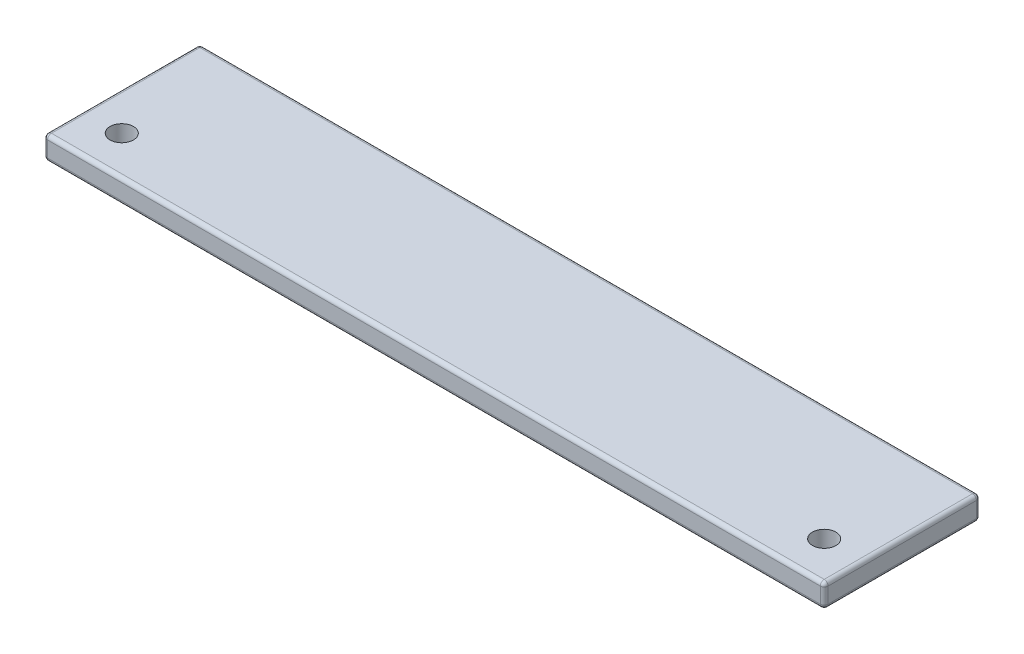
ISO-10303-21;
HEADER;
FILE_DESCRIPTION(('STEP AP214'),'2;1');
FILE_NAME('part.step','',(''),(''),'','','');
FILE_SCHEMA(('AUTOMOTIVE_DESIGN { 1 0 10303 214 1 1 1 1 }'));
ENDSEC;
DATA;
#1=APPLICATION_CONTEXT('core data for automotive mechanical design processes');
#2=APPLICATION_PROTOCOL_DEFINITION('international standard','automotive_design',2000,#1);
#3=PRODUCT_CONTEXT('',#1,'mechanical');
#4=PRODUCT('Part','Part','',(#3));
#5=PRODUCT_RELATED_PRODUCT_CATEGORY('part','',(#4));
#6=PRODUCT_DEFINITION_FORMATION('','',#4);
#7=PRODUCT_DEFINITION_CONTEXT('part definition',#1,'design');
#8=PRODUCT_DEFINITION('design','',#6,#7);
#9=PRODUCT_DEFINITION_SHAPE('','',#8);
#10=(LENGTH_UNIT() NAMED_UNIT(*) SI_UNIT(.MILLI.,.METRE.));
#11=(NAMED_UNIT(*) PLANE_ANGLE_UNIT() SI_UNIT($,.RADIAN.));
#12=(NAMED_UNIT(*) SI_UNIT($,.STERADIAN.) SOLID_ANGLE_UNIT());
#13=UNCERTAINTY_MEASURE_WITH_UNIT(LENGTH_MEASURE(1.E-05),#10,'distance_accuracy_value','');
#14=(GEOMETRIC_REPRESENTATION_CONTEXT(3) GLOBAL_UNCERTAINTY_ASSIGNED_CONTEXT((#13)) GLOBAL_UNIT_ASSIGNED_CONTEXT((#10,
#11,#12)) REPRESENTATION_CONTEXT('',''));
#15=CARTESIAN_POINT('',(0.,0.,0.));
#16=DIRECTION('',(0.,0.,1.));
#17=DIRECTION('',(1.,0.,0.));
#18=AXIS2_PLACEMENT_3D('',#15,#16,#17);
#19=CARTESIAN_POINT('',(0.,3.,0.));
#20=DIRECTION('',(0.,1.,0.));
#21=DIRECTION('',(0.,0.,1.));
#22=AXIS2_PLACEMENT_3D('',#19,#20,#21);
#23=PLANE('',#22);
#24=DIRECTION('',(0.,0.,-1.));
#25=VECTOR('',#24,1.);
#26=CARTESIAN_POINT('',(49.5,3.,-10.));
#27=LINE('',#26,#25);
#28=CARTESIAN_POINT('',(49.5,3.,9.5));
#29=VERTEX_POINT('',#28);
#30=CARTESIAN_POINT('',(49.5,3.,-9.5));
#31=VERTEX_POINT('',#30);
#32=EDGE_CURVE('E44',#29,#31,#27,.T.);
#33=ORIENTED_EDGE('',*,*,#32,.T.);
#34=DIRECTION('',(-1.,0.,0.));
#35=VECTOR('',#34,1.);
#36=CARTESIAN_POINT('',(-50.,3.,-9.49999999999999));
#37=LINE('',#36,#35);
#38=CARTESIAN_POINT('',(-49.5,3.,-9.49999999999999));
#39=VERTEX_POINT('',#38);
#40=EDGE_CURVE('E11',#31,#39,#37,.T.);
#41=ORIENTED_EDGE('',*,*,#40,.T.);
#42=DIRECTION('',(0.,0.,1.));
#43=VECTOR('',#42,1.);
#44=CARTESIAN_POINT('',(-49.5,3.,10.));
#45=LINE('',#44,#43);
#46=CARTESIAN_POINT('',(-49.5,3.,9.50000000000001));
#47=VERTEX_POINT('',#46);
#48=EDGE_CURVE('E202',#39,#47,#45,.T.);
#49=ORIENTED_EDGE('',*,*,#48,.T.);
#50=DIRECTION('',(1.,0.,0.));
#51=VECTOR('',#50,1.);
#52=CARTESIAN_POINT('',(50.,3.,9.5));
#53=LINE('',#52,#51);
#54=EDGE_CURVE('E55',#47,#29,#53,.T.);
#55=ORIENTED_EDGE('',*,*,#54,.T.);
#56=EDGE_LOOP('',(#33,#41,#49,#55));
#57=FACE_BOUND('',#56,.T.);
#58=CARTESIAN_POINT('',(45.,3.,5.));
#59=DIRECTION('',(0.,-1.,0.));
#60=DIRECTION('',(0.,0.,-1.));
#61=AXIS2_PLACEMENT_3D('',#58,#59,#60);
#62=CIRCLE('',#61,1.5);
#63=CARTESIAN_POINT('',(45.,3.,3.5));
#64=VERTEX_POINT('',#63);
#65=EDGE_CURVE('E209',#64,#64,#62,.T.);
#66=ORIENTED_EDGE('',*,*,#65,.T.);
#67=EDGE_LOOP('',(#66));
#68=FACE_BOUND('',#67,.T.);
#69=CARTESIAN_POINT('',(-45.,3.,5.));
#70=DIRECTION('',(0.,1.,0.));
#71=DIRECTION('',(0.,0.,-1.));
#72=AXIS2_PLACEMENT_3D('',#69,#70,#71);
#73=CIRCLE('',#72,1.5);
#74=CARTESIAN_POINT('',(-45.,3.,3.5));
#75=VERTEX_POINT('',#74);
#76=EDGE_CURVE('E309',#75,#75,#73,.T.);
#77=ORIENTED_EDGE('',*,*,#76,.F.);
#78=EDGE_LOOP('',(#77));
#79=FACE_BOUND('',#78,.T.);
#80=ADVANCED_FACE('F35',(#57,#68,#79),#23,.T.);
#81=CARTESIAN_POINT('',(0.,0.,0.));
#82=DIRECTION('',(0.,1.,0.));
#83=DIRECTION('',(0.,0.,1.));
#84=AXIS2_PLACEMENT_3D('',#81,#82,#83);
#85=PLANE('',#84);
#86=CARTESIAN_POINT('',(45.,0.,5.));
#87=DIRECTION('',(0.,-1.,0.));
#88=DIRECTION('',(0.,0.,-1.));
#89=AXIS2_PLACEMENT_3D('',#86,#87,#88);
#90=CIRCLE('',#89,1.5);
#91=CARTESIAN_POINT('',(45.,0.,3.5));
#92=VERTEX_POINT('',#91);
#93=EDGE_CURVE('E161',#92,#92,#90,.T.);
#94=ORIENTED_EDGE('',*,*,#93,.F.);
#95=EDGE_LOOP('',(#94));
#96=FACE_BOUND('',#95,.T.);
#97=DIRECTION('',(0.,0.,-1.));
#98=VECTOR('',#97,1.);
#99=CARTESIAN_POINT('',(49.5,0.,0.));
#100=LINE('',#99,#98);
#101=CARTESIAN_POINT('',(49.5,0.,-9.5));
#102=VERTEX_POINT('',#101);
#103=CARTESIAN_POINT('',(49.5,0.,9.5));
#104=VERTEX_POINT('',#103);
#105=EDGE_CURVE('E170',#102,#104,#100,.F.);
#106=ORIENTED_EDGE('',*,*,#105,.T.);
#107=DIRECTION('',(1.,0.,0.));
#108=VECTOR('',#107,1.);
#109=CARTESIAN_POINT('',(0.,0.,9.5));
#110=LINE('',#109,#108);
#111=CARTESIAN_POINT('',(-49.5,0.,9.50000000000001));
#112=VERTEX_POINT('',#111);
#113=EDGE_CURVE('E172',#104,#112,#110,.F.);
#114=ORIENTED_EDGE('',*,*,#113,.T.);
#115=DIRECTION('',(0.,0.,1.));
#116=VECTOR('',#115,1.);
#117=CARTESIAN_POINT('',(-49.5,0.,0.));
#118=LINE('',#117,#116);
#119=CARTESIAN_POINT('',(-49.5,0.,-9.49999999999999));
#120=VERTEX_POINT('',#119);
#121=EDGE_CURVE('E166',#112,#120,#118,.F.);
#122=ORIENTED_EDGE('',*,*,#121,.T.);
#123=DIRECTION('',(-1.,0.,0.));
#124=VECTOR('',#123,1.);
#125=CARTESIAN_POINT('',(0.,0.,-9.5));
#126=LINE('',#125,#124);
#127=EDGE_CURVE('E168',#120,#102,#126,.F.);
#128=ORIENTED_EDGE('',*,*,#127,.T.);
#129=EDGE_LOOP('',(#106,#114,#122,#128));
#130=FACE_BOUND('',#129,.T.);
#131=CARTESIAN_POINT('',(-45.,0.,5.));
#132=DIRECTION('',(0.,1.,0.));
#133=DIRECTION('',(0.,0.,-1.));
#134=AXIS2_PLACEMENT_3D('',#131,#132,#133);
#135=CIRCLE('',#134,1.5);
#136=CARTESIAN_POINT('',(-45.,0.,3.5));
#137=VERTEX_POINT('',#136);
#138=EDGE_CURVE('E311',#137,#137,#135,.T.);
#139=ORIENTED_EDGE('',*,*,#138,.T.);
#140=EDGE_LOOP('',(#139));
#141=FACE_BOUND('',#140,.T.);
#142=ADVANCED_FACE('F302',(#96,#130,#141),#85,.F.);
#143=CARTESIAN_POINT('',(-50.,3.,10.));
#144=DIRECTION('',(1.,0.,0.));
#145=DIRECTION('',(0.,0.,-1.));
#146=AXIS2_PLACEMENT_3D('',#143,#144,#145);
#147=PLANE('',#146);
#148=DIRECTION('',(0.,0.,1.));
#149=VECTOR('',#148,1.);
#150=CARTESIAN_POINT('',(-50.,0.5,10.));
#151=LINE('',#150,#149);
#152=CARTESIAN_POINT('',(-50.,0.5,-9.49999999999999));
#153=VERTEX_POINT('',#152);
#154=CARTESIAN_POINT('',(-50.,0.5,9.50000000000001));
#155=VERTEX_POINT('',#154);
#156=EDGE_CURVE('E197',#153,#155,#151,.T.);
#157=ORIENTED_EDGE('',*,*,#156,.T.);
#158=DIRECTION('',(0.,-1.,0.));
#159=VECTOR('',#158,1.);
#160=CARTESIAN_POINT('',(-50.,3.,9.50000000000001));
#161=LINE('',#160,#159);
#162=CARTESIAN_POINT('',(-50.,2.5,9.50000000000001));
#163=VERTEX_POINT('',#162);
#164=EDGE_CURVE('E200',#155,#163,#161,.F.);
#165=ORIENTED_EDGE('',*,*,#164,.T.);
#166=DIRECTION('',(0.,0.,1.));
#167=VECTOR('',#166,1.);
#168=CARTESIAN_POINT('',(-50.,2.5,-9.99999999999999));
#169=LINE('',#168,#167);
#170=CARTESIAN_POINT('',(-50.,2.5,-9.49999999999999));
#171=VERTEX_POINT('',#170);
#172=EDGE_CURVE('E195',#163,#171,#169,.F.);
#173=ORIENTED_EDGE('',*,*,#172,.T.);
#174=DIRECTION('',(0.,-1.,0.));
#175=VECTOR('',#174,1.);
#176=CARTESIAN_POINT('',(-50.,3.,-9.49999999999999));
#177=LINE('',#176,#175);
#178=EDGE_CURVE('E193',#171,#153,#177,.T.);
#179=ORIENTED_EDGE('',*,*,#178,.T.);
#180=EDGE_LOOP('',(#157,#165,#173,#179));
#181=FACE_BOUND('',#180,.T.);
#182=ADVANCED_FACE('F332',(#181),#147,.F.);
#183=CARTESIAN_POINT('',(50.,3.,10.));
#184=DIRECTION('',(0.,0.,-1.));
#185=DIRECTION('',(-1.,0.,0.));
#186=AXIS2_PLACEMENT_3D('',#183,#184,#185);
#187=PLANE('',#186);
#188=DIRECTION('',(1.,0.,0.));
#189=VECTOR('',#188,1.);
#190=CARTESIAN_POINT('',(50.,0.5,10.));
#191=LINE('',#190,#189);
#192=CARTESIAN_POINT('',(-49.5,0.5,10.));
#193=VERTEX_POINT('',#192);
#194=CARTESIAN_POINT('',(49.5,0.5,10.));
#195=VERTEX_POINT('',#194);
#196=EDGE_CURVE('E134',#193,#195,#191,.T.);
#197=ORIENTED_EDGE('',*,*,#196,.T.);
#198=DIRECTION('',(0.,-1.,0.));
#199=VECTOR('',#198,1.);
#200=CARTESIAN_POINT('',(49.5,3.,10.));
#201=LINE('',#200,#199);
#202=CARTESIAN_POINT('',(49.5,2.5,10.));
#203=VERTEX_POINT('',#202);
#204=EDGE_CURVE('E130',#195,#203,#201,.F.);
#205=ORIENTED_EDGE('',*,*,#204,.T.);
#206=DIRECTION('',(1.,0.,0.));
#207=VECTOR('',#206,1.);
#208=CARTESIAN_POINT('',(-50.,2.5,10.));
#209=LINE('',#208,#207);
#210=CARTESIAN_POINT('',(-49.5,2.5,10.));
#211=VERTEX_POINT('',#210);
#212=EDGE_CURVE('E122',#203,#211,#209,.F.);
#213=ORIENTED_EDGE('',*,*,#212,.T.);
#214=DIRECTION('',(0.,-1.,0.));
#215=VECTOR('',#214,1.);
#216=CARTESIAN_POINT('',(-49.5,3.,10.));
#217=LINE('',#216,#215);
#218=EDGE_CURVE('E127',#211,#193,#217,.T.);
#219=ORIENTED_EDGE('',*,*,#218,.T.);
#220=EDGE_LOOP('',(#197,#205,#213,#219));
#221=FACE_BOUND('',#220,.T.);
#222=ADVANCED_FACE('F125',(#221),#187,.F.);
#223=CARTESIAN_POINT('',(50.,3.,10.));
#224=DIRECTION('',(-1.,0.,0.));
#225=DIRECTION('',(0.,0.,1.));
#226=AXIS2_PLACEMENT_3D('',#223,#224,#225);
#227=PLANE('',#226);
#228=DIRECTION('',(0.,0.,-1.));
#229=VECTOR('',#228,1.);
#230=CARTESIAN_POINT('',(50.,2.5,10.));
#231=LINE('',#230,#229);
#232=CARTESIAN_POINT('',(50.,2.5,-9.5));
#233=VERTEX_POINT('',#232);
#234=CARTESIAN_POINT('',(50.,2.5,9.5));
#235=VERTEX_POINT('',#234);
#236=EDGE_CURVE('E177',#233,#235,#231,.F.);
#237=ORIENTED_EDGE('',*,*,#236,.T.);
#238=DIRECTION('',(0.,-1.,0.));
#239=VECTOR('',#238,1.);
#240=CARTESIAN_POINT('',(50.,3.,9.5));
#241=LINE('',#240,#239);
#242=CARTESIAN_POINT('',(50.,0.5,9.5));
#243=VERTEX_POINT('',#242);
#244=EDGE_CURVE('E182',#235,#243,#241,.T.);
#245=ORIENTED_EDGE('',*,*,#244,.T.);
#246=DIRECTION('',(0.,0.,-1.));
#247=VECTOR('',#246,1.);
#248=CARTESIAN_POINT('',(50.,0.5,10.));
#249=LINE('',#248,#247);
#250=CARTESIAN_POINT('',(50.,0.5,-9.5));
#251=VERTEX_POINT('',#250);
#252=EDGE_CURVE('E179',#243,#251,#249,.T.);
#253=ORIENTED_EDGE('',*,*,#252,.T.);
#254=DIRECTION('',(0.,-1.,0.));
#255=VECTOR('',#254,1.);
#256=CARTESIAN_POINT('',(50.,3.,-9.5));
#257=LINE('',#256,#255);
#258=EDGE_CURVE('E175',#251,#233,#257,.F.);
#259=ORIENTED_EDGE('',*,*,#258,.T.);
#260=EDGE_LOOP('',(#237,#245,#253,#259));
#261=FACE_BOUND('',#260,.T.);
#262=ADVANCED_FACE('F269',(#261),#227,.F.);
#263=CARTESIAN_POINT('',(50.,3.,-10.));
#264=DIRECTION('',(0.,0.,1.));
#265=DIRECTION('',(1.,0.,0.));
#266=AXIS2_PLACEMENT_3D('',#263,#264,#265);
#267=PLANE('',#266);
#268=DIRECTION('',(-1.,0.,0.));
#269=VECTOR('',#268,1.);
#270=CARTESIAN_POINT('',(50.,2.5,-10.));
#271=LINE('',#270,#269);
#272=CARTESIAN_POINT('',(-49.5,2.5,-9.99999999999999));
#273=VERTEX_POINT('',#272);
#274=CARTESIAN_POINT('',(49.5,2.5,-10.));
#275=VERTEX_POINT('',#274);
#276=EDGE_CURVE('E186',#273,#275,#271,.F.);
#277=ORIENTED_EDGE('',*,*,#276,.T.);
#278=DIRECTION('',(0.,-1.,0.));
#279=VECTOR('',#278,1.);
#280=CARTESIAN_POINT('',(49.5,3.,-10.));
#281=LINE('',#280,#279);
#282=CARTESIAN_POINT('',(49.5,0.5,-10.));
#283=VERTEX_POINT('',#282);
#284=EDGE_CURVE('E191',#275,#283,#281,.T.);
#285=ORIENTED_EDGE('',*,*,#284,.T.);
#286=DIRECTION('',(-1.,0.,0.));
#287=VECTOR('',#286,1.);
#288=CARTESIAN_POINT('',(50.,0.5,-10.));
#289=LINE('',#288,#287);
#290=CARTESIAN_POINT('',(-49.5,0.5,-9.99999999999999));
#291=VERTEX_POINT('',#290);
#292=EDGE_CURVE('E188',#283,#291,#289,.T.);
#293=ORIENTED_EDGE('',*,*,#292,.T.);
#294=DIRECTION('',(0.,-1.,0.));
#295=VECTOR('',#294,1.);
#296=CARTESIAN_POINT('',(-49.5,3.,-9.99999999999999));
#297=LINE('',#296,#295);
#298=EDGE_CURVE('E184',#291,#273,#297,.F.);
#299=ORIENTED_EDGE('',*,*,#298,.T.);
#300=EDGE_LOOP('',(#277,#285,#293,#299));
#301=FACE_BOUND('',#300,.T.);
#302=ADVANCED_FACE('F278',(#301),#267,.F.);
#303=CARTESIAN_POINT('',(0.,2.5,-9.5));
#304=DIRECTION('',(1.,0.,0.));
#305=DIRECTION('',(0.,0.,-1.));
#306=AXIS2_PLACEMENT_3D('',#303,#304,#305);
#307=CYLINDRICAL_SURFACE('',#306,0.5);
#308=CARTESIAN_POINT('',(-49.5,2.5,-9.49999999999999));
#309=DIRECTION('',(-1.,0.,0.));
#310=DIRECTION('',(0.,0.,1.));
#311=AXIS2_PLACEMENT_3D('',#308,#309,#310);
#312=CIRCLE('',#311,0.5);
#313=EDGE_CURVE('E39',#39,#273,#312,.T.);
#314=ORIENTED_EDGE('',*,*,#313,.F.);
#315=ORIENTED_EDGE('',*,*,#40,.F.);
#316=CARTESIAN_POINT('',(49.5,2.5,-9.5));
#317=DIRECTION('',(1.,0.,0.));
#318=DIRECTION('',(0.,0.,-1.));
#319=AXIS2_PLACEMENT_3D('',#316,#317,#318);
#320=CIRCLE('',#319,0.5);
#321=EDGE_CURVE('E159',#275,#31,#320,.T.);
#322=ORIENTED_EDGE('',*,*,#321,.F.);
#323=ORIENTED_EDGE('',*,*,#276,.F.);
#324=EDGE_LOOP('',(#314,#315,#322,#323));
#325=FACE_BOUND('',#324,.T.);
#326=ADVANCED_FACE('F37',(#325),#307,.T.);
#327=CARTESIAN_POINT('',(-49.5,2.5,-9.49999999999999));
#328=DIRECTION('',(0.,0.,1.));
#329=DIRECTION('',(1.,0.,0.));
#330=AXIS2_PLACEMENT_3D('',#327,#328,#329);
#331=SPHERICAL_SURFACE('',#330,0.5);
#332=CARTESIAN_POINT('',(-49.5,2.5,-9.49999999999999));
#333=DIRECTION('',(0.,0.,-1.));
#334=DIRECTION('',(-1.,0.,0.));
#335=AXIS2_PLACEMENT_3D('',#332,#333,#334);
#336=CIRCLE('',#335,0.5);
#337=EDGE_CURVE('E249',#39,#171,#336,.F.);
#338=ORIENTED_EDGE('',*,*,#337,.F.);
#339=ORIENTED_EDGE('',*,*,#313,.T.);
#340=CARTESIAN_POINT('',(-49.5,2.5,-9.49999999999999));
#341=DIRECTION('',(0.,1.,0.));
#342=DIRECTION('',(0.,0.,1.));
#343=AXIS2_PLACEMENT_3D('',#340,#341,#342);
#344=CIRCLE('',#343,0.5);
#345=EDGE_CURVE('E252',#171,#273,#344,.F.);
#346=ORIENTED_EDGE('',*,*,#345,.F.);
#347=EDGE_LOOP('',(#338,#339,#346));
#348=FACE_BOUND('',#347,.T.);
#349=ADVANCED_FACE('F296',(#348),#331,.T.);
#350=CARTESIAN_POINT('',(49.5,2.5,-9.5));
#351=DIRECTION('',(0.,0.,1.));
#352=DIRECTION('',(1.,0.,0.));
#353=AXIS2_PLACEMENT_3D('',#350,#351,#352);
#354=SPHERICAL_SURFACE('',#353,0.5);
#355=CARTESIAN_POINT('',(49.5,2.5,-9.5));
#356=DIRECTION('',(0.,1.,0.));
#357=DIRECTION('',(0.,0.,1.));
#358=AXIS2_PLACEMENT_3D('',#355,#356,#357);
#359=CIRCLE('',#358,0.5);
#360=EDGE_CURVE('E243',#275,#233,#359,.F.);
#361=ORIENTED_EDGE('',*,*,#360,.F.);
#362=ORIENTED_EDGE('',*,*,#321,.T.);
#363=CARTESIAN_POINT('',(49.5,2.5,-9.5));
#364=DIRECTION('',(0.,0.,-1.));
#365=DIRECTION('',(-1.,0.,0.));
#366=AXIS2_PLACEMENT_3D('',#363,#364,#365);
#367=CIRCLE('',#366,0.5);
#368=EDGE_CURVE('E246',#233,#31,#367,.F.);
#369=ORIENTED_EDGE('',*,*,#368,.F.);
#370=EDGE_LOOP('',(#361,#362,#369));
#371=FACE_BOUND('',#370,.T.);
#372=ADVANCED_FACE('F259',(#371),#354,.T.);
#373=CARTESIAN_POINT('',(-49.5,3.,-9.49999999999999));
#374=DIRECTION('',(0.,-1.,0.));
#375=DIRECTION('',(0.,0.,-1.));
#376=AXIS2_PLACEMENT_3D('',#373,#374,#375);
#377=CYLINDRICAL_SURFACE('',#376,0.5);
#378=ORIENTED_EDGE('',*,*,#345,.T.);
#379=ORIENTED_EDGE('',*,*,#298,.F.);
#380=CARTESIAN_POINT('',(-49.5,0.5,-9.49999999999999));
#381=DIRECTION('',(0.,-1.,0.));
#382=DIRECTION('',(0.,0.,-1.));
#383=AXIS2_PLACEMENT_3D('',#380,#381,#382);
#384=CIRCLE('',#383,0.5);
#385=EDGE_CURVE('E238',#153,#291,#384,.T.);
#386=ORIENTED_EDGE('',*,*,#385,.F.);
#387=ORIENTED_EDGE('',*,*,#178,.F.);
#388=EDGE_LOOP('',(#378,#379,#386,#387));
#389=FACE_BOUND('',#388,.T.);
#390=ADVANCED_FACE('F290',(#389),#377,.T.);
#391=CARTESIAN_POINT('',(-49.5,2.5,0.));
#392=DIRECTION('',(0.,0.,-1.));
#393=DIRECTION('',(-1.,0.,0.));
#394=AXIS2_PLACEMENT_3D('',#391,#392,#393);
#395=CYLINDRICAL_SURFACE('',#394,0.5);
#396=ORIENTED_EDGE('',*,*,#337,.T.);
#397=ORIENTED_EDGE('',*,*,#172,.F.);
#398=CARTESIAN_POINT('',(-49.5,2.5,9.50000000000001));
#399=DIRECTION('',(0.,0.,1.));
#400=DIRECTION('',(1.,0.,0.));
#401=AXIS2_PLACEMENT_3D('',#398,#399,#400);
#402=CIRCLE('',#401,0.5);
#403=EDGE_CURVE('E143',#47,#163,#402,.T.);
#404=ORIENTED_EDGE('',*,*,#403,.F.);
#405=ORIENTED_EDGE('',*,*,#48,.F.);
#406=EDGE_LOOP('',(#396,#397,#404,#405));
#407=FACE_BOUND('',#406,.T.);
#408=ADVANCED_FACE('F299',(#407),#395,.T.);
#409=CARTESIAN_POINT('',(0.,2.5,9.5));
#410=DIRECTION('',(-1.,0.,0.));
#411=DIRECTION('',(0.,0.,1.));
#412=AXIS2_PLACEMENT_3D('',#409,#410,#411);
#413=CYLINDRICAL_SURFACE('',#412,0.5);
#414=CARTESIAN_POINT('',(49.5,2.5,9.5));
#415=DIRECTION('',(1.,0.,0.));
#416=DIRECTION('',(0.,0.,-1.));
#417=AXIS2_PLACEMENT_3D('',#414,#415,#416);
#418=CIRCLE('',#417,0.5);
#419=EDGE_CURVE('E144',#29,#203,#418,.T.);
#420=ORIENTED_EDGE('',*,*,#419,.F.);
#421=ORIENTED_EDGE('',*,*,#54,.F.);
#422=CARTESIAN_POINT('',(-49.5,2.5,9.50000000000001));
#423=DIRECTION('',(-1.,0.,0.));
#424=DIRECTION('',(0.,0.,1.));
#425=AXIS2_PLACEMENT_3D('',#422,#423,#424);
#426=CIRCLE('',#425,0.5);
#427=EDGE_CURVE('E137',#211,#47,#426,.T.);
#428=ORIENTED_EDGE('',*,*,#427,.F.);
#429=ORIENTED_EDGE('',*,*,#212,.F.);
#430=EDGE_LOOP('',(#420,#421,#428,#429));
#431=FACE_BOUND('',#430,.T.);
#432=ADVANCED_FACE('F139',(#431),#413,.T.);
#433=CARTESIAN_POINT('',(49.5,2.5,0.));
#434=DIRECTION('',(0.,0.,1.));
#435=DIRECTION('',(1.,0.,0.));
#436=AXIS2_PLACEMENT_3D('',#433,#434,#435);
#437=CYLINDRICAL_SURFACE('',#436,0.5);
#438=ORIENTED_EDGE('',*,*,#368,.T.);
#439=ORIENTED_EDGE('',*,*,#32,.F.);
#440=CARTESIAN_POINT('',(49.5,2.5,9.5));
#441=DIRECTION('',(0.,0.,1.));
#442=DIRECTION('',(1.,0.,0.));
#443=AXIS2_PLACEMENT_3D('',#440,#441,#442);
#444=CIRCLE('',#443,0.5);
#445=EDGE_CURVE('E233',#235,#29,#444,.T.);
#446=ORIENTED_EDGE('',*,*,#445,.F.);
#447=ORIENTED_EDGE('',*,*,#236,.F.);
#448=EDGE_LOOP('',(#438,#439,#446,#447));
#449=FACE_BOUND('',#448,.T.);
#450=ADVANCED_FACE('F265',(#449),#437,.T.);
#451=CARTESIAN_POINT('',(49.5,3.,-9.5));
#452=DIRECTION('',(0.,-1.,0.));
#453=DIRECTION('',(0.,0.,-1.));
#454=AXIS2_PLACEMENT_3D('',#451,#452,#453);
#455=CYLINDRICAL_SURFACE('',#454,0.5);
#456=ORIENTED_EDGE('',*,*,#360,.T.);
#457=ORIENTED_EDGE('',*,*,#258,.F.);
#458=CARTESIAN_POINT('',(49.5,0.5,-9.5));
#459=DIRECTION('',(0.,-1.,0.));
#460=DIRECTION('',(0.,0.,-1.));
#461=AXIS2_PLACEMENT_3D('',#458,#459,#460);
#462=CIRCLE('',#461,0.5);
#463=EDGE_CURVE('E230',#283,#251,#462,.T.);
#464=ORIENTED_EDGE('',*,*,#463,.F.);
#465=ORIENTED_EDGE('',*,*,#284,.F.);
#466=EDGE_LOOP('',(#456,#457,#464,#465));
#467=FACE_BOUND('',#466,.T.);
#468=ADVANCED_FACE('F275',(#467),#455,.T.);
#469=CARTESIAN_POINT('',(50.,0.5,-9.5));
#470=DIRECTION('',(-1.,0.,0.));
#471=DIRECTION('',(0.,0.,1.));
#472=AXIS2_PLACEMENT_3D('',#469,#470,#471);
#473=CYLINDRICAL_SURFACE('',#472,0.5);
#474=CARTESIAN_POINT('',(-49.5,0.5,-9.49999999999999));
#475=DIRECTION('',(-1.,0.,0.));
#476=DIRECTION('',(0.,0.,1.));
#477=AXIS2_PLACEMENT_3D('',#474,#475,#476);
#478=CIRCLE('',#477,0.5);
#479=EDGE_CURVE('E240',#291,#120,#478,.T.);
#480=ORIENTED_EDGE('',*,*,#479,.F.);
#481=ORIENTED_EDGE('',*,*,#292,.F.);
#482=CARTESIAN_POINT('',(49.5,0.5,-9.5));
#483=DIRECTION('',(1.,0.,0.));
#484=DIRECTION('',(0.,0.,-1.));
#485=AXIS2_PLACEMENT_3D('',#482,#483,#484);
#486=CIRCLE('',#485,0.5);
#487=EDGE_CURVE('E227',#102,#283,#486,.T.);
#488=ORIENTED_EDGE('',*,*,#487,.F.);
#489=ORIENTED_EDGE('',*,*,#127,.F.);
#490=EDGE_LOOP('',(#480,#481,#488,#489));
#491=FACE_BOUND('',#490,.T.);
#492=ADVANCED_FACE('F282',(#491),#473,.T.);
#493=CARTESIAN_POINT('',(-49.5,0.5,-9.49999999999999));
#494=DIRECTION('',(0.,0.,1.));
#495=DIRECTION('',(1.,0.,0.));
#496=AXIS2_PLACEMENT_3D('',#493,#494,#495);
#497=SPHERICAL_SURFACE('',#496,0.5);
#498=ORIENTED_EDGE('',*,*,#385,.T.);
#499=ORIENTED_EDGE('',*,*,#479,.T.);
#500=CARTESIAN_POINT('',(-49.5,0.5,-9.49999999999999));
#501=DIRECTION('',(0.,0.,-1.));
#502=DIRECTION('',(-1.,0.,0.));
#503=AXIS2_PLACEMENT_3D('',#500,#501,#502);
#504=CIRCLE('',#503,0.5);
#505=EDGE_CURVE('E151',#153,#120,#504,.F.);
#506=ORIENTED_EDGE('',*,*,#505,.F.);
#507=EDGE_LOOP('',(#498,#499,#506));
#508=FACE_BOUND('',#507,.T.);
#509=ADVANCED_FACE('F378',(#508),#497,.T.);
#510=CARTESIAN_POINT('',(-49.5,2.5,9.50000000000001));
#511=DIRECTION('',(0.,0.,1.));
#512=DIRECTION('',(1.,0.,0.));
#513=AXIS2_PLACEMENT_3D('',#510,#511,#512);
#514=SPHERICAL_SURFACE('',#513,0.5);
#515=ORIENTED_EDGE('',*,*,#427,.T.);
#516=ORIENTED_EDGE('',*,*,#403,.T.);
#517=CARTESIAN_POINT('',(-49.5,2.5,9.50000000000001));
#518=DIRECTION('',(0.,1.,0.));
#519=DIRECTION('',(0.,0.,1.));
#520=AXIS2_PLACEMENT_3D('',#517,#518,#519);
#521=CIRCLE('',#520,0.5);
#522=EDGE_CURVE('E147',#211,#163,#521,.F.);
#523=ORIENTED_EDGE('',*,*,#522,.F.);
#524=EDGE_LOOP('',(#515,#516,#523));
#525=FACE_BOUND('',#524,.T.);
#526=ADVANCED_FACE('F148',(#525),#514,.T.);
#527=CARTESIAN_POINT('',(49.5,2.5,9.5));
#528=DIRECTION('',(0.,0.,1.));
#529=DIRECTION('',(1.,0.,0.));
#530=AXIS2_PLACEMENT_3D('',#527,#528,#529);
#531=SPHERICAL_SURFACE('',#530,0.5);
#532=ORIENTED_EDGE('',*,*,#445,.T.);
#533=ORIENTED_EDGE('',*,*,#419,.T.);
#534=CARTESIAN_POINT('',(49.5,2.5,9.5));
#535=DIRECTION('',(0.,1.,0.));
#536=DIRECTION('',(0.,0.,1.));
#537=AXIS2_PLACEMENT_3D('',#534,#535,#536);
#538=CIRCLE('',#537,0.5);
#539=EDGE_CURVE('E152',#235,#203,#538,.F.);
#540=ORIENTED_EDGE('',*,*,#539,.F.);
#541=EDGE_LOOP('',(#532,#533,#540));
#542=FACE_BOUND('',#541,.T.);
#543=ADVANCED_FACE('F371',(#542),#531,.T.);
#544=CARTESIAN_POINT('',(49.5,0.5,-9.5));
#545=DIRECTION('',(0.,0.,1.));
#546=DIRECTION('',(1.,0.,0.));
#547=AXIS2_PLACEMENT_3D('',#544,#545,#546);
#548=SPHERICAL_SURFACE('',#547,0.5);
#549=ORIENTED_EDGE('',*,*,#487,.T.);
#550=ORIENTED_EDGE('',*,*,#463,.T.);
#551=CARTESIAN_POINT('',(49.5,0.5,-9.5));
#552=DIRECTION('',(0.,0.,-1.));
#553=DIRECTION('',(-1.,0.,0.));
#554=AXIS2_PLACEMENT_3D('',#551,#552,#553);
#555=CIRCLE('',#554,0.5);
#556=EDGE_CURVE('E221',#102,#251,#555,.F.);
#557=ORIENTED_EDGE('',*,*,#556,.F.);
#558=EDGE_LOOP('',(#549,#550,#557));
#559=FACE_BOUND('',#558,.T.);
#560=ADVANCED_FACE('F367',(#559),#548,.T.);
#561=CARTESIAN_POINT('',(-49.5,0.5,10.));
#562=DIRECTION('',(0.,0.,1.));
#563=DIRECTION('',(1.,0.,0.));
#564=AXIS2_PLACEMENT_3D('',#561,#562,#563);
#565=CYLINDRICAL_SURFACE('',#564,0.5);
#566=ORIENTED_EDGE('',*,*,#505,.T.);
#567=ORIENTED_EDGE('',*,*,#121,.F.);
#568=CARTESIAN_POINT('',(-49.5,0.5,9.50000000000001));
#569=DIRECTION('',(0.,0.,1.));
#570=DIRECTION('',(1.,0.,0.));
#571=AXIS2_PLACEMENT_3D('',#568,#569,#570);
#572=CIRCLE('',#571,0.5);
#573=EDGE_CURVE('E218',#155,#112,#572,.T.);
#574=ORIENTED_EDGE('',*,*,#573,.F.);
#575=ORIENTED_EDGE('',*,*,#156,.F.);
#576=EDGE_LOOP('',(#566,#567,#574,#575));
#577=FACE_BOUND('',#576,.T.);
#578=ADVANCED_FACE('F364',(#577),#565,.T.);
#579=CARTESIAN_POINT('',(-49.5,3.,9.50000000000001));
#580=DIRECTION('',(0.,-1.,0.));
#581=DIRECTION('',(0.,0.,-1.));
#582=AXIS2_PLACEMENT_3D('',#579,#580,#581);
#583=CYLINDRICAL_SURFACE('',#582,0.5);
#584=ORIENTED_EDGE('',*,*,#522,.T.);
#585=ORIENTED_EDGE('',*,*,#164,.F.);
#586=CARTESIAN_POINT('',(-49.5,0.5,9.50000000000001));
#587=DIRECTION('',(0.,-1.,0.));
#588=DIRECTION('',(0.,0.,-1.));
#589=AXIS2_PLACEMENT_3D('',#586,#587,#588);
#590=CIRCLE('',#589,0.5);
#591=EDGE_CURVE('E155',#193,#155,#590,.T.);
#592=ORIENTED_EDGE('',*,*,#591,.F.);
#593=ORIENTED_EDGE('',*,*,#218,.F.);
#594=EDGE_LOOP('',(#584,#585,#592,#593));
#595=FACE_BOUND('',#594,.T.);
#596=ADVANCED_FACE('F154',(#595),#583,.T.);
#597=CARTESIAN_POINT('',(49.5,3.,9.5));
#598=DIRECTION('',(0.,-1.,0.));
#599=DIRECTION('',(0.,0.,-1.));
#600=AXIS2_PLACEMENT_3D('',#597,#598,#599);
#601=CYLINDRICAL_SURFACE('',#600,0.5);
#602=ORIENTED_EDGE('',*,*,#539,.T.);
#603=ORIENTED_EDGE('',*,*,#204,.F.);
#604=CARTESIAN_POINT('',(49.5,0.5,9.5));
#605=DIRECTION('',(0.,-1.,0.));
#606=DIRECTION('',(0.,0.,-1.));
#607=AXIS2_PLACEMENT_3D('',#604,#605,#606);
#608=CIRCLE('',#607,0.5);
#609=EDGE_CURVE('E214',#243,#195,#608,.T.);
#610=ORIENTED_EDGE('',*,*,#609,.F.);
#611=ORIENTED_EDGE('',*,*,#244,.F.);
#612=EDGE_LOOP('',(#602,#603,#610,#611));
#613=FACE_BOUND('',#612,.T.);
#614=ADVANCED_FACE('F357',(#613),#601,.T.);
#615=CARTESIAN_POINT('',(49.5,0.5,10.));
#616=DIRECTION('',(0.,0.,-1.));
#617=DIRECTION('',(-1.,0.,0.));
#618=AXIS2_PLACEMENT_3D('',#615,#616,#617);
#619=CYLINDRICAL_SURFACE('',#618,0.5);
#620=ORIENTED_EDGE('',*,*,#556,.T.);
#621=ORIENTED_EDGE('',*,*,#252,.F.);
#622=CARTESIAN_POINT('',(49.5,0.5,9.5));
#623=DIRECTION('',(0.,0.,1.));
#624=DIRECTION('',(1.,0.,0.));
#625=AXIS2_PLACEMENT_3D('',#622,#623,#624);
#626=CIRCLE('',#625,0.5);
#627=EDGE_CURVE('E211',#104,#243,#626,.T.);
#628=ORIENTED_EDGE('',*,*,#627,.F.);
#629=ORIENTED_EDGE('',*,*,#105,.F.);
#630=EDGE_LOOP('',(#620,#621,#628,#629));
#631=FACE_BOUND('',#630,.T.);
#632=ADVANCED_FACE('F353',(#631),#619,.T.);
#633=CARTESIAN_POINT('',(-49.5,0.5,9.50000000000001));
#634=DIRECTION('',(0.,0.,1.));
#635=DIRECTION('',(1.,0.,0.));
#636=AXIS2_PLACEMENT_3D('',#633,#634,#635);
#637=SPHERICAL_SURFACE('',#636,0.5);
#638=ORIENTED_EDGE('',*,*,#591,.T.);
#639=ORIENTED_EDGE('',*,*,#573,.T.);
#640=CARTESIAN_POINT('',(-49.5,0.5,9.50000000000001));
#641=DIRECTION('',(-1.,0.,0.));
#642=DIRECTION('',(0.,0.,1.));
#643=AXIS2_PLACEMENT_3D('',#640,#641,#642);
#644=CIRCLE('',#643,0.5);
#645=EDGE_CURVE('E208',#193,#112,#644,.F.);
#646=ORIENTED_EDGE('',*,*,#645,.F.);
#647=EDGE_LOOP('',(#638,#639,#646));
#648=FACE_BOUND('',#647,.T.);
#649=ADVANCED_FACE('F349',(#648),#637,.T.);
#650=CARTESIAN_POINT('',(49.5,0.5,9.5));
#651=DIRECTION('',(0.,0.,1.));
#652=DIRECTION('',(1.,0.,0.));
#653=AXIS2_PLACEMENT_3D('',#650,#651,#652);
#654=SPHERICAL_SURFACE('',#653,0.5);
#655=ORIENTED_EDGE('',*,*,#627,.T.);
#656=ORIENTED_EDGE('',*,*,#609,.T.);
#657=CARTESIAN_POINT('',(49.5,0.5,9.5));
#658=DIRECTION('',(1.,0.,0.));
#659=DIRECTION('',(0.,0.,-1.));
#660=AXIS2_PLACEMENT_3D('',#657,#658,#659);
#661=CIRCLE('',#660,0.5);
#662=EDGE_CURVE('E206',#104,#195,#661,.F.);
#663=ORIENTED_EDGE('',*,*,#662,.F.);
#664=EDGE_LOOP('',(#655,#656,#663));
#665=FACE_BOUND('',#664,.T.);
#666=ADVANCED_FACE('F345',(#665),#654,.T.);
#667=CARTESIAN_POINT('',(50.,0.5,9.5));
#668=DIRECTION('',(1.,0.,0.));
#669=DIRECTION('',(0.,0.,-1.));
#670=AXIS2_PLACEMENT_3D('',#667,#668,#669);
#671=CYLINDRICAL_SURFACE('',#670,0.5);
#672=ORIENTED_EDGE('',*,*,#645,.T.);
#673=ORIENTED_EDGE('',*,*,#113,.F.);
#674=ORIENTED_EDGE('',*,*,#662,.T.);
#675=ORIENTED_EDGE('',*,*,#196,.F.);
#676=EDGE_LOOP('',(#672,#673,#674,#675));
#677=FACE_BOUND('',#676,.T.);
#678=ADVANCED_FACE('F326',(#677),#671,.T.);
#679=CARTESIAN_POINT('',(45.,3.,5.));
#680=DIRECTION('',(0.,-1.,0.));
#681=DIRECTION('',(0.,0.,-1.));
#682=AXIS2_PLACEMENT_3D('',#679,#680,#681);
#683=CYLINDRICAL_SURFACE('',#682,1.5);
#684=ORIENTED_EDGE('',*,*,#65,.F.);
#685=EDGE_LOOP('',(#684));
#686=FACE_BOUND('',#685,.T.);
#687=ORIENTED_EDGE('',*,*,#93,.T.);
#688=EDGE_LOOP('',(#687));
#689=FACE_BOUND('',#688,.T.);
#690=ADVANCED_FACE('F321',(#686,#689),#683,.F.);
#691=CARTESIAN_POINT('',(-45.,3.,5.));
#692=DIRECTION('',(0.,-1.,0.));
#693=DIRECTION('',(0.,0.,-1.));
#694=AXIS2_PLACEMENT_3D('',#691,#692,#693);
#695=CYLINDRICAL_SURFACE('',#694,1.5);
#696=ORIENTED_EDGE('',*,*,#76,.T.);
#697=EDGE_LOOP('',(#696));
#698=FACE_BOUND('',#697,.T.);
#699=ORIENTED_EDGE('',*,*,#138,.F.);
#700=EDGE_LOOP('',(#699));
#701=FACE_BOUND('',#700,.T.);
#702=ADVANCED_FACE('F319',(#698,#701),#695,.F.);
#703=CLOSED_SHELL('',(#80,#142,#182,#222,#262,#302,#326,#349,#372,#390,#408,#432,#450,#468,#492,
#509,#526,#543,#560,#578,#596,#614,#632,#649,#666,#678,#690,#702));
#704=MANIFOLD_SOLID_BREP('B2',#703);
#705=ADVANCED_BREP_SHAPE_REPRESENTATION('',(#18,#704),#14);
#706=SHAPE_DEFINITION_REPRESENTATION(#9,#705);
ENDSEC;
END-ISO-10303-21;
